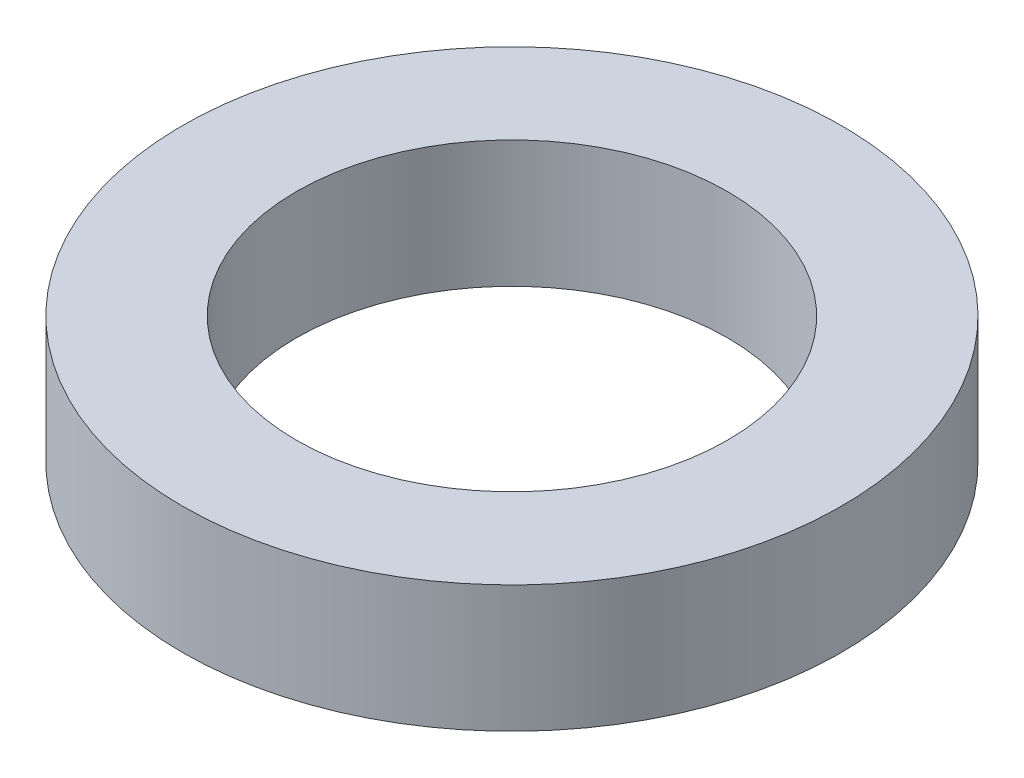
ISO-10303-21;
HEADER;
FILE_DESCRIPTION(('STEP AP214'),'2;1');
FILE_NAME('part.step','',(''),(''),'','','');
FILE_SCHEMA(('AUTOMOTIVE_DESIGN { 1 0 10303 214 1 1 1 1 }'));
ENDSEC;
DATA;
#1=APPLICATION_CONTEXT('core data for automotive mechanical design processes');
#2=APPLICATION_PROTOCOL_DEFINITION('international standard','automotive_design',2000,#1);
#3=PRODUCT_CONTEXT('',#1,'mechanical');
#4=PRODUCT('Part','Part','',(#3));
#5=PRODUCT_RELATED_PRODUCT_CATEGORY('part','',(#4));
#6=PRODUCT_DEFINITION_FORMATION('','',#4);
#7=PRODUCT_DEFINITION_CONTEXT('part definition',#1,'design');
#8=PRODUCT_DEFINITION('design','',#6,#7);
#9=PRODUCT_DEFINITION_SHAPE('','',#8);
#10=(LENGTH_UNIT() NAMED_UNIT(*) SI_UNIT(.MILLI.,.METRE.));
#11=(NAMED_UNIT(*) PLANE_ANGLE_UNIT() SI_UNIT($,.RADIAN.));
#12=(NAMED_UNIT(*) SI_UNIT($,.STERADIAN.) SOLID_ANGLE_UNIT());
#13=UNCERTAINTY_MEASURE_WITH_UNIT(LENGTH_MEASURE(1.E-05),#10,'distance_accuracy_value','');
#14=(GEOMETRIC_REPRESENTATION_CONTEXT(3) GLOBAL_UNCERTAINTY_ASSIGNED_CONTEXT((#13)) GLOBAL_UNIT_ASSIGNED_CONTEXT((#10,
#11,#12)) REPRESENTATION_CONTEXT('',''));
#15=CARTESIAN_POINT('',(0.,0.,0.));
#16=DIRECTION('',(0.,0.,1.));
#17=DIRECTION('',(1.,0.,0.));
#18=AXIS2_PLACEMENT_3D('',#15,#16,#17);
#19=CARTESIAN_POINT('',(0.,5.,0.));
#20=DIRECTION('',(0.,1.,0.));
#21=DIRECTION('',(0.,0.,1.));
#22=AXIS2_PLACEMENT_3D('',#19,#20,#21);
#23=PLANE('',#22);
#24=CARTESIAN_POINT('',(0.,5.,0.));
#25=DIRECTION('',(0.,1.,0.));
#26=DIRECTION('',(0.,0.,1.));
#27=AXIS2_PLACEMENT_3D('',#24,#25,#26);
#28=CIRCLE('',#27,13.);
#29=CARTESIAN_POINT('',(0.,5.,13.));
#30=VERTEX_POINT('',#29);
#31=EDGE_CURVE('E10',#30,#30,#28,.T.);
#32=ORIENTED_EDGE('',*,*,#31,.T.);
#33=EDGE_LOOP('',(#32));
#34=FACE_BOUND('',#33,.T.);
#35=CARTESIAN_POINT('',(0.,5.,0.));
#36=DIRECTION('',(0.,1.,0.));
#37=DIRECTION('',(0.,0.,1.));
#38=AXIS2_PLACEMENT_3D('',#35,#36,#37);
#39=CIRCLE('',#38,8.5);
#40=CARTESIAN_POINT('',(0.,5.,8.5));
#41=VERTEX_POINT('',#40);
#42=EDGE_CURVE('E44',#41,#41,#39,.T.);
#43=ORIENTED_EDGE('',*,*,#42,.F.);
#44=EDGE_LOOP('',(#43));
#45=FACE_BOUND('',#44,.T.);
#46=ADVANCED_FACE('F33',(#34,#45),#23,.T.);
#47=CARTESIAN_POINT('',(0.,0.,0.));
#48=DIRECTION('',(0.,1.,0.));
#49=DIRECTION('',(0.,0.,1.));
#50=AXIS2_PLACEMENT_3D('',#47,#48,#49);
#51=PLANE('',#50);
#52=CARTESIAN_POINT('',(0.,0.,0.));
#53=DIRECTION('',(0.,1.,0.));
#54=DIRECTION('',(0.,0.,1.));
#55=AXIS2_PLACEMENT_3D('',#52,#53,#54);
#56=CIRCLE('',#55,13.);
#57=CARTESIAN_POINT('',(0.,0.,13.));
#58=VERTEX_POINT('',#57);
#59=EDGE_CURVE('E37',#58,#58,#56,.T.);
#60=ORIENTED_EDGE('',*,*,#59,.F.);
#61=EDGE_LOOP('',(#60));
#62=FACE_BOUND('',#61,.T.);
#63=CARTESIAN_POINT('',(0.,0.,0.));
#64=DIRECTION('',(0.,1.,0.));
#65=DIRECTION('',(0.,0.,1.));
#66=AXIS2_PLACEMENT_3D('',#63,#64,#65);
#67=CIRCLE('',#66,8.5);
#68=CARTESIAN_POINT('',(0.,0.,8.5));
#69=VERTEX_POINT('',#68);
#70=EDGE_CURVE('E46',#69,#69,#67,.T.);
#71=ORIENTED_EDGE('',*,*,#70,.T.);
#72=EDGE_LOOP('',(#71));
#73=FACE_BOUND('',#72,.T.);
#74=ADVANCED_FACE('F56',(#62,#73),#51,.F.);
#75=CARTESIAN_POINT('',(0.,5.,0.));
#76=DIRECTION('',(0.,-1.,0.));
#77=DIRECTION('',(0.,0.,-1.));
#78=AXIS2_PLACEMENT_3D('',#75,#76,#77);
#79=CYLINDRICAL_SURFACE('',#78,13.);
#80=ORIENTED_EDGE('',*,*,#31,.F.);
#81=EDGE_LOOP('',(#80));
#82=FACE_BOUND('',#81,.T.);
#83=ORIENTED_EDGE('',*,*,#59,.T.);
#84=EDGE_LOOP('',(#83));
#85=FACE_BOUND('',#84,.T.);
#86=ADVANCED_FACE('F35',(#82,#85),#79,.T.);
#87=CARTESIAN_POINT('',(0.,5.,0.));
#88=DIRECTION('',(0.,-1.,0.));
#89=DIRECTION('',(0.,0.,-1.));
#90=AXIS2_PLACEMENT_3D('',#87,#88,#89);
#91=CYLINDRICAL_SURFACE('',#90,8.5);
#92=ORIENTED_EDGE('',*,*,#42,.T.);
#93=EDGE_LOOP('',(#92));
#94=FACE_BOUND('',#93,.T.);
#95=ORIENTED_EDGE('',*,*,#70,.F.);
#96=EDGE_LOOP('',(#95));
#97=FACE_BOUND('',#96,.T.);
#98=ADVANCED_FACE('F52',(#94,#97),#91,.F.);
#99=CLOSED_SHELL('',(#46,#74,#86,#98));
#100=MANIFOLD_SOLID_BREP('B2',#99);
#101=ADVANCED_BREP_SHAPE_REPRESENTATION('',(#18,#100),#14);
#102=SHAPE_DEFINITION_REPRESENTATION(#9,#101);
ENDSEC;
END-ISO-10303-21;
